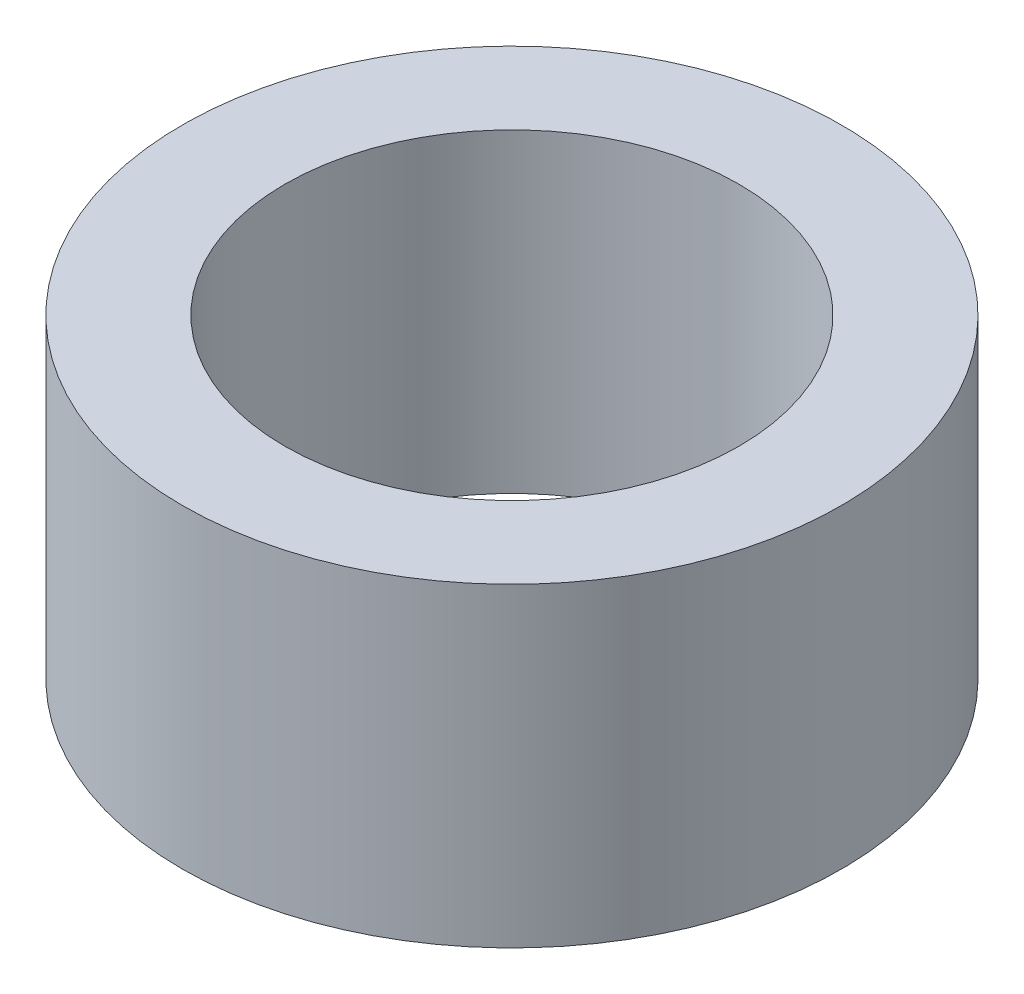
ISO-10303-21;
HEADER;
FILE_DESCRIPTION(('STEP AP214'),'2;1');
FILE_NAME('part.step','',(''),(''),'','','');
FILE_SCHEMA(('AUTOMOTIVE_DESIGN { 1 0 10303 214 1 1 1 1 }'));
ENDSEC;
DATA;
#1=APPLICATION_CONTEXT('core data for automotive mechanical design processes');
#2=APPLICATION_PROTOCOL_DEFINITION('international standard','automotive_design',2000,#1);
#3=PRODUCT_CONTEXT('',#1,'mechanical');
#4=PRODUCT('Part','Part','',(#3));
#5=PRODUCT_RELATED_PRODUCT_CATEGORY('part','',(#4));
#6=PRODUCT_DEFINITION_FORMATION('','',#4);
#7=PRODUCT_DEFINITION_CONTEXT('part definition',#1,'design');
#8=PRODUCT_DEFINITION('design','',#6,#7);
#9=PRODUCT_DEFINITION_SHAPE('','',#8);
#10=(LENGTH_UNIT() NAMED_UNIT(*) SI_UNIT(.MILLI.,.METRE.));
#11=(NAMED_UNIT(*) PLANE_ANGLE_UNIT() SI_UNIT($,.RADIAN.));
#12=(NAMED_UNIT(*) SI_UNIT($,.STERADIAN.) SOLID_ANGLE_UNIT());
#13=UNCERTAINTY_MEASURE_WITH_UNIT(LENGTH_MEASURE(1.E-05),#10,'distance_accuracy_value','');
#14=(GEOMETRIC_REPRESENTATION_CONTEXT(3) GLOBAL_UNCERTAINTY_ASSIGNED_CONTEXT((#13)) GLOBAL_UNIT_ASSIGNED_CONTEXT((#10,
#11,#12)) REPRESENTATION_CONTEXT('',''));
#15=CARTESIAN_POINT('',(0.,0.,0.));
#16=DIRECTION('',(0.,0.,1.));
#17=DIRECTION('',(1.,0.,0.));
#18=AXIS2_PLACEMENT_3D('',#15,#16,#17);
#19=CARTESIAN_POINT('',(0.,4.3,0.));
#20=DIRECTION('',(0.,1.,0.));
#21=DIRECTION('',(0.,0.,1.));
#22=AXIS2_PLACEMENT_3D('',#19,#20,#21);
#23=PLANE('',#22);
#24=CARTESIAN_POINT('',(0.,4.3,0.));
#25=DIRECTION('',(0.,1.,0.));
#26=DIRECTION('',(0.,0.,1.));
#27=AXIS2_PLACEMENT_3D('',#24,#25,#26);
#28=CIRCLE('',#27,4.5);
#29=CARTESIAN_POINT('',(0.,4.3,4.5));
#30=VERTEX_POINT('',#29);
#31=EDGE_CURVE('E10',#30,#30,#28,.T.);
#32=ORIENTED_EDGE('',*,*,#31,.T.);
#33=EDGE_LOOP('',(#32));
#34=FACE_BOUND('',#33,.T.);
#35=CARTESIAN_POINT('',(0.,4.3,0.));
#36=DIRECTION('',(0.,1.,0.));
#37=DIRECTION('',(0.,0.,1.));
#38=AXIS2_PLACEMENT_3D('',#35,#36,#37);
#39=CIRCLE('',#38,3.1);
#40=CARTESIAN_POINT('',(0.,4.3,3.1));
#41=VERTEX_POINT('',#40);
#42=EDGE_CURVE('E50',#41,#41,#39,.T.);
#43=ORIENTED_EDGE('',*,*,#42,.F.);
#44=EDGE_LOOP('',(#43));
#45=FACE_BOUND('',#44,.T.);
#46=ADVANCED_FACE('F37',(#34,#45),#23,.T.);
#47=CARTESIAN_POINT('',(0.,0.,0.));
#48=DIRECTION('',(0.,1.,0.));
#49=DIRECTION('',(0.,0.,1.));
#50=AXIS2_PLACEMENT_3D('',#47,#48,#49);
#51=PLANE('',#50);
#52=CARTESIAN_POINT('',(0.,0.,0.));
#53=DIRECTION('',(0.,1.,0.));
#54=DIRECTION('',(0.,0.,1.));
#55=AXIS2_PLACEMENT_3D('',#52,#53,#54);
#56=CIRCLE('',#55,4.5);
#57=CARTESIAN_POINT('',(0.,0.,4.5));
#58=VERTEX_POINT('',#57);
#59=EDGE_CURVE('E41',#58,#58,#56,.T.);
#60=ORIENTED_EDGE('',*,*,#59,.F.);
#61=EDGE_LOOP('',(#60));
#62=FACE_BOUND('',#61,.T.);
#63=CARTESIAN_POINT('',(0.,0.,0.));
#64=DIRECTION('',(0.,1.,0.));
#65=DIRECTION('',(0.,0.,1.));
#66=AXIS2_PLACEMENT_3D('',#63,#64,#65);
#67=CIRCLE('',#66,3.1);
#68=CARTESIAN_POINT('',(0.,0.,3.1));
#69=VERTEX_POINT('',#68);
#70=EDGE_CURVE('E52',#69,#69,#67,.T.);
#71=ORIENTED_EDGE('',*,*,#70,.T.);
#72=EDGE_LOOP('',(#71));
#73=FACE_BOUND('',#72,.T.);
#74=ADVANCED_FACE('F64',(#62,#73),#51,.F.);
#75=CARTESIAN_POINT('',(0.,4.3,0.));
#76=DIRECTION('',(0.,-1.,0.));
#77=DIRECTION('',(0.,0.,-1.));
#78=AXIS2_PLACEMENT_3D('',#75,#76,#77);
#79=CYLINDRICAL_SURFACE('',#78,4.5);
#80=ORIENTED_EDGE('',*,*,#31,.F.);
#81=EDGE_LOOP('',(#80));
#82=FACE_BOUND('',#81,.T.);
#83=ORIENTED_EDGE('',*,*,#59,.T.);
#84=EDGE_LOOP('',(#83));
#85=FACE_BOUND('',#84,.T.);
#86=ADVANCED_FACE('F39',(#82,#85),#79,.T.);
#87=CARTESIAN_POINT('',(0.,4.3,0.));
#88=DIRECTION('',(0.,-1.,0.));
#89=DIRECTION('',(0.,0.,-1.));
#90=AXIS2_PLACEMENT_3D('',#87,#88,#89);
#91=CYLINDRICAL_SURFACE('',#90,3.1);
#92=ORIENTED_EDGE('',*,*,#42,.T.);
#93=EDGE_LOOP('',(#92));
#94=FACE_BOUND('',#93,.T.);
#95=ORIENTED_EDGE('',*,*,#70,.F.);
#96=EDGE_LOOP('',(#95));
#97=FACE_BOUND('',#96,.T.);
#98=ADVANCED_FACE('F60',(#94,#97),#91,.F.);
#99=CLOSED_SHELL('',(#46,#74,#86,#98));
#100=MANIFOLD_SOLID_BREP('B2',#99);
#101=ADVANCED_BREP_SHAPE_REPRESENTATION('',(#18,#100),#14);
#102=SHAPE_DEFINITION_REPRESENTATION(#9,#101);
ENDSEC;
END-ISO-10303-21;
